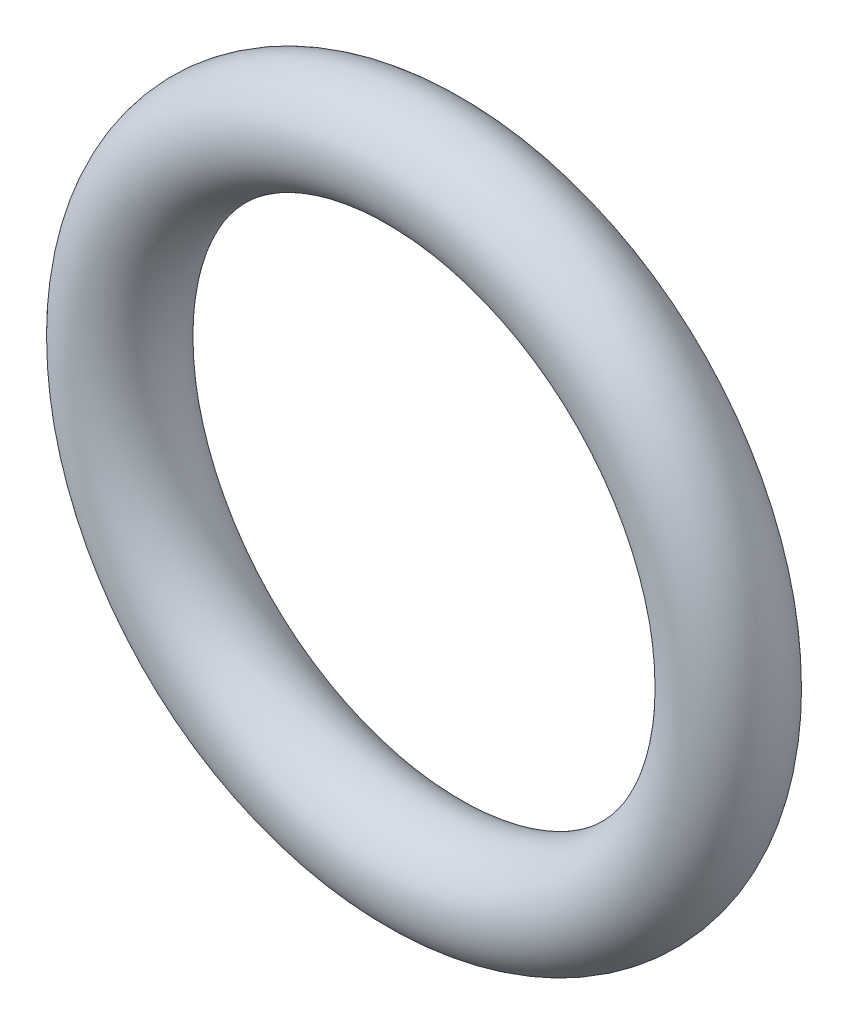
ISO-10303-21;
HEADER;
FILE_DESCRIPTION(('STEP AP214'),'2;1');
FILE_NAME('part.step','',(''),(''),'','','');
FILE_SCHEMA(('AUTOMOTIVE_DESIGN { 1 0 10303 214 1 1 1 1 }'));
ENDSEC;
DATA;
#1=APPLICATION_CONTEXT('core data for automotive mechanical design processes');
#2=APPLICATION_PROTOCOL_DEFINITION('international standard','automotive_design',2000,#1);
#3=PRODUCT_CONTEXT('',#1,'mechanical');
#4=PRODUCT('Part','Part','',(#3));
#5=PRODUCT_RELATED_PRODUCT_CATEGORY('part','',(#4));
#6=PRODUCT_DEFINITION_FORMATION('','',#4);
#7=PRODUCT_DEFINITION_CONTEXT('part definition',#1,'design');
#8=PRODUCT_DEFINITION('design','',#6,#7);
#9=PRODUCT_DEFINITION_SHAPE('','',#8);
#10=(LENGTH_UNIT() NAMED_UNIT(*) SI_UNIT(.MILLI.,.METRE.));
#11=(NAMED_UNIT(*) PLANE_ANGLE_UNIT() SI_UNIT($,.RADIAN.));
#12=(NAMED_UNIT(*) SI_UNIT($,.STERADIAN.) SOLID_ANGLE_UNIT());
#13=UNCERTAINTY_MEASURE_WITH_UNIT(LENGTH_MEASURE(1.E-05),#10,'distance_accuracy_value','');
#14=(GEOMETRIC_REPRESENTATION_CONTEXT(3) GLOBAL_UNCERTAINTY_ASSIGNED_CONTEXT((#13)) GLOBAL_UNIT_ASSIGNED_CONTEXT((#10,
#11,#12)) REPRESENTATION_CONTEXT('',''));
#15=CARTESIAN_POINT('',(0.,0.,0.));
#16=DIRECTION('',(0.,0.,1.));
#17=DIRECTION('',(1.,0.,0.));
#18=AXIS2_PLACEMENT_3D('',#15,#16,#17);
#19=CARTESIAN_POINT('',(0.,0.,0.));
#20=DIRECTION('',(0.,0.,1.));
#21=DIRECTION('',(1.,0.,0.));
#22=AXIS2_PLACEMENT_3D('',#19,#20,#21);
#23=TOROIDAL_SURFACE('',#22,5.3721,0.9144);
#24=CARTESIAN_POINT('',(6.2865,0.,0.));
#25=VERTEX_POINT('',#24);
#26=VERTEX_LOOP('',#25);
#27=FACE_BOUND('',#26,.T.);
#28=ADVANCED_FACE('F32',(#27),#23,.T.);
#29=CLOSED_SHELL('',(#28));
#30=MANIFOLD_SOLID_BREP('B2',#29);
#31=ADVANCED_BREP_SHAPE_REPRESENTATION('',(#18,#30),#14);
#32=SHAPE_DEFINITION_REPRESENTATION(#9,#31);
ENDSEC;
END-ISO-10303-21;
